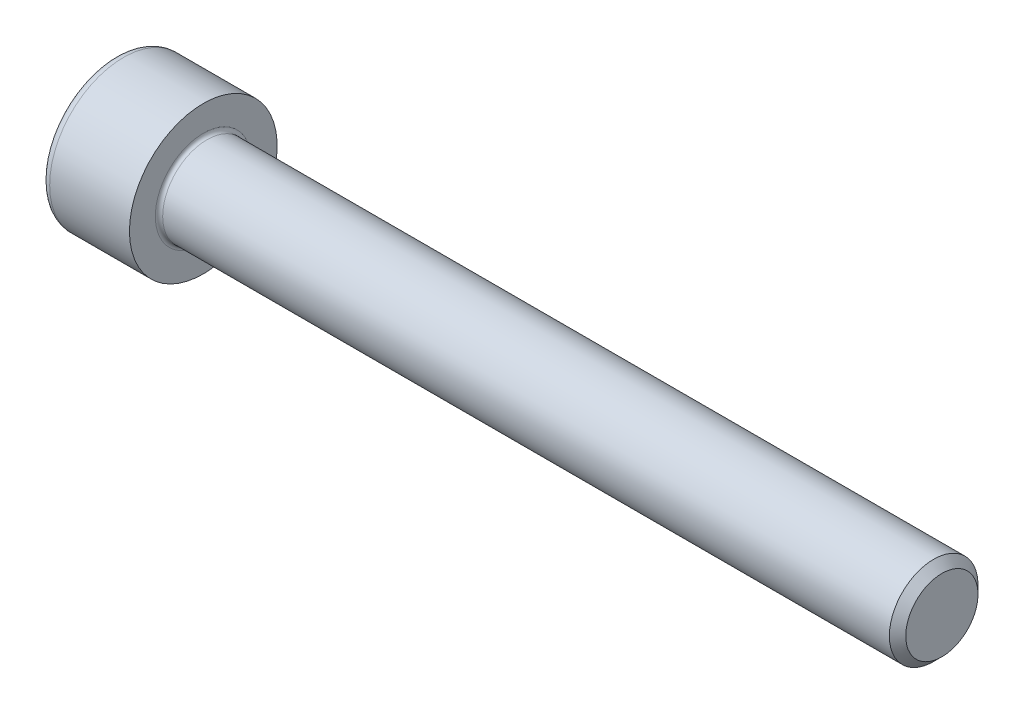
ISO-10303-21;
HEADER;
FILE_DESCRIPTION(('STEP AP214'),'2;1');
FILE_NAME('part.step','',(''),(''),'','','');
FILE_SCHEMA(('AUTOMOTIVE_DESIGN { 1 0 10303 214 1 1 1 1 }'));
ENDSEC;
DATA;
#1=APPLICATION_CONTEXT('core data for automotive mechanical design processes');
#2=APPLICATION_PROTOCOL_DEFINITION('international standard','automotive_design',2000,#1);
#3=PRODUCT_CONTEXT('',#1,'mechanical');
#4=PRODUCT('Part','Part','',(#3));
#5=PRODUCT_RELATED_PRODUCT_CATEGORY('part','',(#4));
#6=PRODUCT_DEFINITION_FORMATION('','',#4);
#7=PRODUCT_DEFINITION_CONTEXT('part definition',#1,'design');
#8=PRODUCT_DEFINITION('design','',#6,#7);
#9=PRODUCT_DEFINITION_SHAPE('','',#8);
#10=(LENGTH_UNIT() NAMED_UNIT(*) SI_UNIT(.MILLI.,.METRE.));
#11=(NAMED_UNIT(*) PLANE_ANGLE_UNIT() SI_UNIT($,.RADIAN.));
#12=(NAMED_UNIT(*) SI_UNIT($,.STERADIAN.) SOLID_ANGLE_UNIT());
#13=UNCERTAINTY_MEASURE_WITH_UNIT(LENGTH_MEASURE(1.E-05),#10,'distance_accuracy_value','');
#14=(GEOMETRIC_REPRESENTATION_CONTEXT(3) GLOBAL_UNCERTAINTY_ASSIGNED_CONTEXT((#13)) GLOBAL_UNIT_ASSIGNED_CONTEXT((#10,
#11,#12)) REPRESENTATION_CONTEXT('',''));
#15=CARTESIAN_POINT('',(0.,0.,0.));
#16=DIRECTION('',(0.,0.,1.));
#17=DIRECTION('',(1.,0.,0.));
#18=AXIS2_PLACEMENT_3D('',#15,#16,#17);
#19=CARTESIAN_POINT('',(0.,0.,0.));
#20=DIRECTION('',(-1.,0.,0.));
#21=DIRECTION('',(0.,0.,1.));
#22=AXIS2_PLACEMENT_3D('',#19,#20,#21);
#23=PLANE('',#22);
#24=DIRECTION('',(0.,-0.499999999999999,0.866025403784439));
#25=VECTOR('',#24,1.);
#26=CARTESIAN_POINT('',(0.,2.89829835133192,0.));
#27=LINE('',#26,#25);
#28=CARTESIAN_POINT('',(0.,2.89829835133192,0.));
#29=VERTEX_POINT('',#28);
#30=CARTESIAN_POINT('',(0.,1.44914917566596,2.51));
#31=VERTEX_POINT('',#30);
#32=EDGE_CURVE('E258',#29,#31,#27,.T.);
#33=ORIENTED_EDGE('',*,*,#32,.T.);
#34=DIRECTION('',(0.,1.,0.));
#35=VECTOR('',#34,1.);
#36=CARTESIAN_POINT('',(0.,-1.44914917566596,2.51));
#37=LINE('',#36,#35);
#38=CARTESIAN_POINT('',(0.,-1.44914917566596,2.51));
#39=VERTEX_POINT('',#38);
#40=EDGE_CURVE('E130',#39,#31,#37,.T.);
#41=ORIENTED_EDGE('',*,*,#40,.F.);
#42=DIRECTION('',(0.,-0.500000000000001,-0.866025403784438));
#43=VECTOR('',#42,1.);
#44=CARTESIAN_POINT('',(0.,-1.44914917566596,2.51));
#45=LINE('',#44,#43);
#46=CARTESIAN_POINT('',(0.,-2.89829835133193,0.));
#47=VERTEX_POINT('',#46);
#48=EDGE_CURVE('E261',#39,#47,#45,.T.);
#49=ORIENTED_EDGE('',*,*,#48,.T.);
#50=DIRECTION('',(0.,0.499999999999998,-0.86602540378444));
#51=VECTOR('',#50,1.);
#52=CARTESIAN_POINT('',(0.,-2.89829835133193,0.));
#53=LINE('',#52,#51);
#54=CARTESIAN_POINT('',(0.,-1.44914917566597,-2.51));
#55=VERTEX_POINT('',#54);
#56=EDGE_CURVE('E264',#47,#55,#53,.T.);
#57=ORIENTED_EDGE('',*,*,#56,.T.);
#58=DIRECTION('',(0.,-1.,0.));
#59=VECTOR('',#58,1.);
#60=CARTESIAN_POINT('',(0.,1.44914917566595,-2.51));
#61=LINE('',#60,#59);
#62=CARTESIAN_POINT('',(0.,1.44914917566595,-2.51));
#63=VERTEX_POINT('',#62);
#64=EDGE_CURVE('E267',#63,#55,#61,.T.);
#65=ORIENTED_EDGE('',*,*,#64,.F.);
#66=DIRECTION('',(0.,-0.500000000000001,-0.866025403784438));
#67=VECTOR('',#66,1.);
#68=CARTESIAN_POINT('',(0.,2.89829835133192,0.));
#69=LINE('',#68,#67);
#70=EDGE_CURVE('E125',#29,#63,#69,.T.);
#71=ORIENTED_EDGE('',*,*,#70,.F.);
#72=EDGE_LOOP('',(#33,#41,#49,#57,#65,#71));
#73=FACE_BOUND('',#72,.T.);
#74=CARTESIAN_POINT('',(0.,0.,0.));
#75=DIRECTION('',(-1.,0.,0.));
#76=DIRECTION('',(0.,0.,1.));
#77=AXIS2_PLACEMENT_3D('',#74,#75,#76);
#78=CIRCLE('',#77,4.4);
#79=CARTESIAN_POINT('',(0.,0.,4.4));
#80=VERTEX_POINT('',#79);
#81=EDGE_CURVE('E42',#80,#80,#78,.T.);
#82=ORIENTED_EDGE('',*,*,#81,.T.);
#83=EDGE_LOOP('',(#82));
#84=FACE_BOUND('',#83,.T.);
#85=ADVANCED_FACE('F34',(#73,#84),#23,.T.);
#86=CARTESIAN_POINT('',(-31.75,0.,0.));
#87=DIRECTION('',(-1.,0.,0.));
#88=DIRECTION('',(0.,0.,1.));
#89=AXIS2_PLACEMENT_3D('',#86,#87,#88);
#90=CYLINDRICAL_SURFACE('',#89,5.);
#91=CARTESIAN_POINT('',(0.600000000000003,0.,0.));
#92=DIRECTION('',(-1.,0.,0.));
#93=DIRECTION('',(0.,0.,1.));
#94=AXIS2_PLACEMENT_3D('',#91,#92,#93);
#95=CIRCLE('',#94,5.);
#96=CARTESIAN_POINT('',(0.600000000000003,0.,5.));
#97=VERTEX_POINT('',#96);
#98=EDGE_CURVE('E11',#97,#97,#95,.F.);
#99=ORIENTED_EDGE('',*,*,#98,.T.);
#100=EDGE_LOOP('',(#99));
#101=FACE_BOUND('',#100,.T.);
#102=CARTESIAN_POINT('',(6.,0.,0.));
#103=DIRECTION('',(-1.,0.,0.));
#104=DIRECTION('',(0.,0.,1.));
#105=AXIS2_PLACEMENT_3D('',#102,#103,#104);
#106=CIRCLE('',#105,5.);
#107=CARTESIAN_POINT('',(6.,0.,5.));
#108=VERTEX_POINT('',#107);
#109=EDGE_CURVE('E148',#108,#108,#106,.T.);
#110=ORIENTED_EDGE('',*,*,#109,.T.);
#111=EDGE_LOOP('',(#110));
#112=FACE_BOUND('',#111,.T.);
#113=ADVANCED_FACE('F172',(#101,#112),#90,.T.);
#114=CARTESIAN_POINT('',(6.,5.,0.));
#115=DIRECTION('',(1.,0.,0.));
#116=DIRECTION('',(0.,0.,-1.));
#117=AXIS2_PLACEMENT_3D('',#114,#115,#116);
#118=PLANE('',#117);
#119=CARTESIAN_POINT('',(6.,0.,0.));
#120=DIRECTION('',(1.,0.,0.));
#121=DIRECTION('',(0.,0.,-1.));
#122=AXIS2_PLACEMENT_3D('',#119,#120,#121);
#123=CIRCLE('',#122,3.24999999999999);
#124=CARTESIAN_POINT('',(6.,0.,-3.24999999999999));
#125=VERTEX_POINT('',#124);
#126=EDGE_CURVE('E151',#125,#125,#123,.F.);
#127=ORIENTED_EDGE('',*,*,#126,.T.);
#128=EDGE_LOOP('',(#127));
#129=FACE_BOUND('',#128,.T.);
#130=ORIENTED_EDGE('',*,*,#109,.F.);
#131=EDGE_LOOP('',(#130));
#132=FACE_BOUND('',#131,.T.);
#133=ADVANCED_FACE('F178',(#129,#132),#118,.T.);
#134=CARTESIAN_POINT('',(-31.75,0.,0.));
#135=DIRECTION('',(-1.,0.,0.));
#136=DIRECTION('',(0.,0.,1.));
#137=AXIS2_PLACEMENT_3D('',#134,#135,#136);
#138=CYLINDRICAL_SURFACE('',#137,2.99999999999999);
#139=CARTESIAN_POINT('',(6.25,0.,0.));
#140=DIRECTION('',(1.,0.,0.));
#141=DIRECTION('',(0.,0.,-1.));
#142=AXIS2_PLACEMENT_3D('',#139,#140,#141);
#143=CIRCLE('',#142,2.99999999999999);
#144=CARTESIAN_POINT('',(6.25,0.,-2.99999999999999));
#145=VERTEX_POINT('',#144);
#146=EDGE_CURVE('E154',#145,#145,#143,.T.);
#147=ORIENTED_EDGE('',*,*,#146,.T.);
#148=EDGE_LOOP('',(#147));
#149=FACE_BOUND('',#148,.T.);
#150=CARTESIAN_POINT('',(55.4455,0.,0.));
#151=DIRECTION('',(-1.,0.,0.));
#152=DIRECTION('',(0.,0.,1.));
#153=AXIS2_PLACEMENT_3D('',#150,#151,#152);
#154=CIRCLE('',#153,2.99999999999999);
#155=CARTESIAN_POINT('',(55.4455,0.,2.99999999999999));
#156=VERTEX_POINT('',#155);
#157=EDGE_CURVE('E145',#156,#156,#154,.T.);
#158=ORIENTED_EDGE('',*,*,#157,.T.);
#159=EDGE_LOOP('',(#158));
#160=FACE_BOUND('',#159,.T.);
#161=ADVANCED_FACE('F184',(#149,#160),#138,.T.);
#162=CARTESIAN_POINT('',(56.,0.,0.));
#163=DIRECTION('',(-1.,0.,0.));
#164=DIRECTION('',(0.,0.,1.));
#165=AXIS2_PLACEMENT_3D('',#162,#163,#164);
#166=CONICAL_SURFACE('',#165,2.4455,0.785398163397424);
#167=ORIENTED_EDGE('',*,*,#157,.F.);
#168=EDGE_LOOP('',(#167));
#169=FACE_BOUND('',#168,.T.);
#170=CARTESIAN_POINT('',(56.,0.,0.));
#171=DIRECTION('',(-1.,0.,0.));
#172=DIRECTION('',(0.,0.,1.));
#173=AXIS2_PLACEMENT_3D('',#170,#171,#172);
#174=CIRCLE('',#173,2.4455);
#175=CARTESIAN_POINT('',(56.,0.,2.4455));
#176=VERTEX_POINT('',#175);
#177=EDGE_CURVE('E141',#176,#176,#174,.T.);
#178=ORIENTED_EDGE('',*,*,#177,.T.);
#179=EDGE_LOOP('',(#178));
#180=FACE_BOUND('',#179,.T.);
#181=ADVANCED_FACE('F188',(#169,#180),#166,.T.);
#182=CARTESIAN_POINT('',(56.,2.4455,0.));
#183=DIRECTION('',(1.,0.,0.));
#184=DIRECTION('',(0.,0.,-1.));
#185=AXIS2_PLACEMENT_3D('',#182,#183,#184);
#186=PLANE('',#185);
#187=ORIENTED_EDGE('',*,*,#177,.F.);
#188=EDGE_LOOP('',(#187));
#189=FACE_BOUND('',#188,.T.);
#190=ADVANCED_FACE('F168',(#189),#186,.T.);
#191=CARTESIAN_POINT('',(6.25,0.,0.));
#192=DIRECTION('',(1.,0.,0.));
#193=DIRECTION('',(0.,0.,-1.));
#194=AXIS2_PLACEMENT_3D('',#191,#192,#193);
#195=TOROIDAL_SURFACE('',#194,3.24999999999999,0.25);
#196=ORIENTED_EDGE('',*,*,#146,.F.);
#197=EDGE_LOOP('',(#196));
#198=FACE_BOUND('',#197,.T.);
#199=ORIENTED_EDGE('',*,*,#126,.F.);
#200=EDGE_LOOP('',(#199));
#201=FACE_BOUND('',#200,.T.);
#202=ADVANCED_FACE('F161',(#198,#201),#195,.F.);
#203=CARTESIAN_POINT('',(0.600000000000003,0.,0.));
#204=DIRECTION('',(-1.,0.,0.));
#205=DIRECTION('',(0.,0.,1.));
#206=AXIS2_PLACEMENT_3D('',#203,#204,#205);
#207=TOROIDAL_SURFACE('',#206,4.4,0.6);
#208=ORIENTED_EDGE('',*,*,#98,.F.);
#209=EDGE_LOOP('',(#208));
#210=FACE_BOUND('',#209,.T.);
#211=ORIENTED_EDGE('',*,*,#81,.F.);
#212=EDGE_LOOP('',(#211));
#213=FACE_BOUND('',#212,.T.);
#214=ADVANCED_FACE('F36',(#210,#213),#207,.T.);
#215=CARTESIAN_POINT('',(3.,2.89829835133192,0.));
#216=DIRECTION('',(0.,-0.866025403784439,-0.499999999999998));
#217=DIRECTION('',(0.,0.499999999999999,-0.86602540378444));
#218=AXIS2_PLACEMENT_3D('',#215,#216,#217);
#219=PLANE('',#218);
#220=ORIENTED_EDGE('',*,*,#32,.F.);
#221=DIRECTION('',(-1.,0.,0.));
#222=VECTOR('',#221,1.);
#223=CARTESIAN_POINT('',(3.,2.89829835133192,0.));
#224=LINE('',#223,#222);
#225=CARTESIAN_POINT('',(3.,2.89829835133192,0.));
#226=VERTEX_POINT('',#225);
#227=EDGE_CURVE('E248',#226,#29,#224,.T.);
#228=ORIENTED_EDGE('',*,*,#227,.F.);
#229=DIRECTION('',(0.,-0.499999999999999,0.866025403784439));
#230=VECTOR('',#229,1.);
#231=CARTESIAN_POINT('',(3.,2.89829835133192,0.));
#232=LINE('',#231,#230);
#233=CARTESIAN_POINT('',(3.,2.17372376349894,1.25499999999999));
#234=VERTEX_POINT('',#233);
#235=EDGE_CURVE('E117',#226,#234,#232,.T.);
#236=ORIENTED_EDGE('',*,*,#235,.T.);
#237=CARTESIAN_POINT('',(3.,1.44914917566596,2.51));
#238=VERTEX_POINT('',#237);
#239=EDGE_CURVE('E108',#234,#238,#232,.T.);
#240=ORIENTED_EDGE('',*,*,#239,.T.);
#241=DIRECTION('',(-1.,0.,0.));
#242=VECTOR('',#241,1.);
#243=CARTESIAN_POINT('',(3.,1.44914917566596,2.51));
#244=LINE('',#243,#242);
#245=EDGE_CURVE('E122',#238,#31,#244,.T.);
#246=ORIENTED_EDGE('',*,*,#245,.T.);
#247=EDGE_LOOP('',(#220,#228,#236,#240,#246));
#248=FACE_BOUND('',#247,.T.);
#249=ADVANCED_FACE('F121',(#248),#219,.T.);
#250=CARTESIAN_POINT('',(3.,-1.44914917566596,2.51));
#251=DIRECTION('',(0.,0.,1.));
#252=DIRECTION('',(0.,-1.,0.));
#253=AXIS2_PLACEMENT_3D('',#250,#251,#252);
#254=PLANE('',#253);
#255=ORIENTED_EDGE('',*,*,#40,.T.);
#256=ORIENTED_EDGE('',*,*,#245,.F.);
#257=DIRECTION('',(0.,1.,0.));
#258=VECTOR('',#257,1.);
#259=CARTESIAN_POINT('',(3.,-1.44914917566596,2.51));
#260=LINE('',#259,#258);
#261=CARTESIAN_POINT('',(3.,0.,2.51));
#262=VERTEX_POINT('',#261);
#263=EDGE_CURVE('E105',#262,#238,#260,.T.);
#264=ORIENTED_EDGE('',*,*,#263,.F.);
#265=CARTESIAN_POINT('',(3.,-1.44914917566596,2.51));
#266=VERTEX_POINT('',#265);
#267=EDGE_CURVE('E116',#266,#262,#260,.T.);
#268=ORIENTED_EDGE('',*,*,#267,.F.);
#269=DIRECTION('',(-1.,0.,0.));
#270=VECTOR('',#269,1.);
#271=CARTESIAN_POINT('',(3.,-1.44914917566596,2.51));
#272=LINE('',#271,#270);
#273=EDGE_CURVE('E132',#266,#39,#272,.T.);
#274=ORIENTED_EDGE('',*,*,#273,.T.);
#275=EDGE_LOOP('',(#255,#256,#264,#268,#274));
#276=FACE_BOUND('',#275,.T.);
#277=ADVANCED_FACE('F127',(#276),#254,.F.);
#278=CARTESIAN_POINT('',(3.,-1.44914917566596,2.51));
#279=DIRECTION('',(0.,0.866025403784438,-0.500000000000001));
#280=DIRECTION('',(0.,0.500000000000001,0.866025403784438));
#281=AXIS2_PLACEMENT_3D('',#278,#279,#280);
#282=PLANE('',#281);
#283=ORIENTED_EDGE('',*,*,#48,.F.);
#284=ORIENTED_EDGE('',*,*,#273,.F.);
#285=DIRECTION('',(0.,-0.500000000000001,-0.866025403784438));
#286=VECTOR('',#285,1.);
#287=CARTESIAN_POINT('',(3.,-1.44914917566596,2.51));
#288=LINE('',#287,#286);
#289=CARTESIAN_POINT('',(3.,-2.17372376349895,1.25500000000001));
#290=VERTEX_POINT('',#289);
#291=EDGE_CURVE('E287',#266,#290,#288,.T.);
#292=ORIENTED_EDGE('',*,*,#291,.T.);
#293=CARTESIAN_POINT('',(3.,-2.89829835133193,0.));
#294=VERTEX_POINT('',#293);
#295=EDGE_CURVE('E276',#290,#294,#288,.T.);
#296=ORIENTED_EDGE('',*,*,#295,.T.);
#297=DIRECTION('',(-1.,0.,0.));
#298=VECTOR('',#297,1.);
#299=CARTESIAN_POINT('',(3.,-2.89829835133193,0.));
#300=LINE('',#299,#298);
#301=EDGE_CURVE('E137',#294,#47,#300,.T.);
#302=ORIENTED_EDGE('',*,*,#301,.T.);
#303=EDGE_LOOP('',(#283,#284,#292,#296,#302));
#304=FACE_BOUND('',#303,.T.);
#305=ADVANCED_FACE('F202',(#304),#282,.T.);
#306=CARTESIAN_POINT('',(3.,-2.89829835133193,0.));
#307=DIRECTION('',(0.,0.86602540378444,0.499999999999998));
#308=DIRECTION('',(0.,-0.499999999999998,0.86602540378444));
#309=AXIS2_PLACEMENT_3D('',#306,#307,#308);
#310=PLANE('',#309);
#311=ORIENTED_EDGE('',*,*,#56,.F.);
#312=ORIENTED_EDGE('',*,*,#301,.F.);
#313=DIRECTION('',(0.,0.499999999999998,-0.86602540378444));
#314=VECTOR('',#313,1.);
#315=CARTESIAN_POINT('',(3.,-2.89829835133193,0.));
#316=LINE('',#315,#314);
#317=CARTESIAN_POINT('',(3.,-2.17372376349895,-1.255));
#318=VERTEX_POINT('',#317);
#319=EDGE_CURVE('E254',#294,#318,#316,.T.);
#320=ORIENTED_EDGE('',*,*,#319,.T.);
#321=CARTESIAN_POINT('',(3.,-1.44914917566597,-2.51));
#322=VERTEX_POINT('',#321);
#323=EDGE_CURVE('E286',#318,#322,#316,.T.);
#324=ORIENTED_EDGE('',*,*,#323,.T.);
#325=DIRECTION('',(-1.,0.,0.));
#326=VECTOR('',#325,1.);
#327=CARTESIAN_POINT('',(3.,-1.44914917566597,-2.51));
#328=LINE('',#327,#326);
#329=EDGE_CURVE('E247',#322,#55,#328,.T.);
#330=ORIENTED_EDGE('',*,*,#329,.T.);
#331=EDGE_LOOP('',(#311,#312,#320,#324,#330));
#332=FACE_BOUND('',#331,.T.);
#333=ADVANCED_FACE('F205',(#332),#310,.T.);
#334=CARTESIAN_POINT('',(3.,1.44914917566595,-2.51));
#335=DIRECTION('',(0.,0.,-1.));
#336=DIRECTION('',(0.,1.,0.));
#337=AXIS2_PLACEMENT_3D('',#334,#335,#336);
#338=PLANE('',#337);
#339=ORIENTED_EDGE('',*,*,#64,.T.);
#340=ORIENTED_EDGE('',*,*,#329,.F.);
#341=DIRECTION('',(0.,-1.,0.));
#342=VECTOR('',#341,1.);
#343=CARTESIAN_POINT('',(3.,1.44914917566595,-2.51));
#344=LINE('',#343,#342);
#345=CARTESIAN_POINT('',(3.,0.,-2.51));
#346=VERTEX_POINT('',#345);
#347=EDGE_CURVE('E251',#346,#322,#344,.T.);
#348=ORIENTED_EDGE('',*,*,#347,.F.);
#349=CARTESIAN_POINT('',(3.,1.44914917566595,-2.51));
#350=VERTEX_POINT('',#349);
#351=EDGE_CURVE('E49',#350,#346,#344,.T.);
#352=ORIENTED_EDGE('',*,*,#351,.F.);
#353=DIRECTION('',(-1.,0.,0.));
#354=VECTOR('',#353,1.);
#355=CARTESIAN_POINT('',(3.,1.44914917566595,-2.51));
#356=LINE('',#355,#354);
#357=EDGE_CURVE('E244',#350,#63,#356,.T.);
#358=ORIENTED_EDGE('',*,*,#357,.T.);
#359=EDGE_LOOP('',(#339,#340,#348,#352,#358));
#360=FACE_BOUND('',#359,.T.);
#361=ADVANCED_FACE('F209',(#360),#338,.F.);
#362=CARTESIAN_POINT('',(3.,2.89829835133192,0.));
#363=DIRECTION('',(0.,0.866025403784438,-0.500000000000001));
#364=DIRECTION('',(0.,0.500000000000001,0.866025403784438));
#365=AXIS2_PLACEMENT_3D('',#362,#363,#364);
#366=PLANE('',#365);
#367=ORIENTED_EDGE('',*,*,#70,.T.);
#368=ORIENTED_EDGE('',*,*,#357,.F.);
#369=DIRECTION('',(0.,-0.500000000000001,-0.866025403784438));
#370=VECTOR('',#369,1.);
#371=CARTESIAN_POINT('',(3.,2.89829835133192,0.));
#372=LINE('',#371,#370);
#373=CARTESIAN_POINT('',(3.,2.17372376349894,-1.255));
#374=VERTEX_POINT('',#373);
#375=EDGE_CURVE('E234',#374,#350,#372,.T.);
#376=ORIENTED_EDGE('',*,*,#375,.F.);
#377=EDGE_CURVE('E240',#226,#374,#372,.T.);
#378=ORIENTED_EDGE('',*,*,#377,.F.);
#379=ORIENTED_EDGE('',*,*,#227,.T.);
#380=EDGE_LOOP('',(#367,#368,#376,#378,#379));
#381=FACE_BOUND('',#380,.T.);
#382=ADVANCED_FACE('F213',(#381),#366,.F.);
#383=CARTESIAN_POINT('',(3.,4.34744752699787,-2.51000000000001));
#384=DIRECTION('',(1.,0.,0.));
#385=DIRECTION('',(0.,0.,-1.));
#386=AXIS2_PLACEMENT_3D('',#383,#384,#385);
#387=PLANE('',#386);
#388=ORIENTED_EDGE('',*,*,#347,.T.);
#389=ORIENTED_EDGE('',*,*,#323,.F.);
#390=CARTESIAN_POINT('',(3.,0.,0.));
#391=DIRECTION('',(-1.,0.,0.));
#392=DIRECTION('',(0.,0.,1.));
#393=AXIS2_PLACEMENT_3D('',#390,#391,#392);
#394=CIRCLE('',#393,2.51);
#395=EDGE_CURVE('E282',#346,#318,#394,.T.);
#396=ORIENTED_EDGE('',*,*,#395,.F.);
#397=EDGE_LOOP('',(#388,#389,#396));
#398=FACE_BOUND('',#397,.T.);
#399=ADVANCED_FACE('F217',(#398),#387,.F.);
#400=ORIENTED_EDGE('',*,*,#319,.F.);
#401=ORIENTED_EDGE('',*,*,#295,.F.);
#402=EDGE_CURVE('E135',#318,#290,#394,.T.);
#403=ORIENTED_EDGE('',*,*,#402,.F.);
#404=EDGE_LOOP('',(#400,#401,#403));
#405=FACE_BOUND('',#404,.T.);
#406=ADVANCED_FACE('F220',(#405),#387,.F.);
#407=ORIENTED_EDGE('',*,*,#291,.F.);
#408=ORIENTED_EDGE('',*,*,#267,.T.);
#409=EDGE_CURVE('E131',#290,#262,#394,.T.);
#410=ORIENTED_EDGE('',*,*,#409,.F.);
#411=EDGE_LOOP('',(#407,#408,#410));
#412=FACE_BOUND('',#411,.T.);
#413=ADVANCED_FACE('F225',(#412),#387,.F.);
#414=ORIENTED_EDGE('',*,*,#263,.T.);
#415=ORIENTED_EDGE('',*,*,#239,.F.);
#416=EDGE_CURVE('E111',#262,#234,#394,.T.);
#417=ORIENTED_EDGE('',*,*,#416,.F.);
#418=EDGE_LOOP('',(#414,#415,#417));
#419=FACE_BOUND('',#418,.T.);
#420=ADVANCED_FACE('F107',(#419),#387,.F.);
#421=ORIENTED_EDGE('',*,*,#235,.F.);
#422=ORIENTED_EDGE('',*,*,#377,.T.);
#423=EDGE_CURVE('E142',#234,#374,#394,.T.);
#424=ORIENTED_EDGE('',*,*,#423,.F.);
#425=EDGE_LOOP('',(#421,#422,#424));
#426=FACE_BOUND('',#425,.T.);
#427=ADVANCED_FACE('F228',(#426),#387,.F.);
#428=ORIENTED_EDGE('',*,*,#375,.T.);
#429=ORIENTED_EDGE('',*,*,#351,.T.);
#430=EDGE_CURVE('E237',#374,#346,#394,.T.);
#431=ORIENTED_EDGE('',*,*,#430,.F.);
#432=EDGE_LOOP('',(#428,#429,#431));
#433=FACE_BOUND('',#432,.T.);
#434=ADVANCED_FACE('F198',(#433),#387,.F.);
#435=CARTESIAN_POINT('',(3.,0.,0.));
#436=DIRECTION('',(-1.,0.,0.));
#437=DIRECTION('',(0.,0.,1.));
#438=AXIS2_PLACEMENT_3D('',#435,#436,#437);
#439=CONICAL_SURFACE('',#438,2.51,1.04719755119659);
#440=CARTESIAN_POINT('',(4.44914917566598,0.,0.));
#441=VERTEX_POINT('',#440);
#442=VERTEX_LOOP('',#441);
#443=FACE_BOUND('',#442,.T.);
#444=ORIENTED_EDGE('',*,*,#416,.T.);
#445=ORIENTED_EDGE('',*,*,#423,.T.);
#446=ORIENTED_EDGE('',*,*,#430,.T.);
#447=ORIENTED_EDGE('',*,*,#395,.T.);
#448=ORIENTED_EDGE('',*,*,#402,.T.);
#449=ORIENTED_EDGE('',*,*,#409,.T.);
#450=EDGE_LOOP('',(#444,#445,#446,#447,#448,#449));
#451=FACE_BOUND('',#450,.T.);
#452=ADVANCED_FACE('F196',(#443,#451),#439,.F.);
#453=CLOSED_SHELL('',(#85,#113,#133,#161,#181,#190,#202,#214,#249,#277,#305,#333,#361,#382,#399,
#406,#413,#420,#427,#434,#452));
#454=MANIFOLD_SOLID_BREP('B2',#453);
#455=ADVANCED_BREP_SHAPE_REPRESENTATION('',(#18,#454),#14);
#456=SHAPE_DEFINITION_REPRESENTATION(#9,#455);
ENDSEC;
END-ISO-10303-21;
